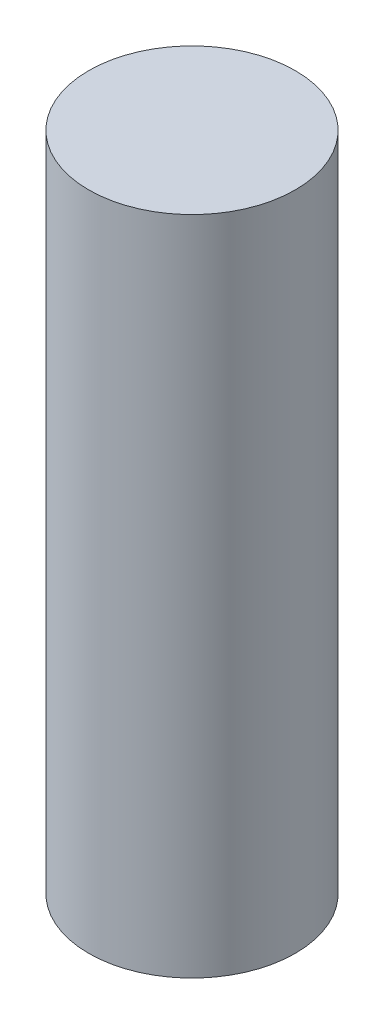
ISO-10303-21;
HEADER;
FILE_DESCRIPTION(('STEP AP214'),'2;1');
FILE_NAME('part.step','',(''),(''),'','','');
FILE_SCHEMA(('AUTOMOTIVE_DESIGN { 1 0 10303 214 1 1 1 1 }'));
ENDSEC;
DATA;
#1=APPLICATION_CONTEXT('core data for automotive mechanical design processes');
#2=APPLICATION_PROTOCOL_DEFINITION('international standard','automotive_design',2000,#1);
#3=PRODUCT_CONTEXT('',#1,'mechanical');
#4=PRODUCT('Part','Part','',(#3));
#5=PRODUCT_RELATED_PRODUCT_CATEGORY('part','',(#4));
#6=PRODUCT_DEFINITION_FORMATION('','',#4);
#7=PRODUCT_DEFINITION_CONTEXT('part definition',#1,'design');
#8=PRODUCT_DEFINITION('design','',#6,#7);
#9=PRODUCT_DEFINITION_SHAPE('','',#8);
#10=(LENGTH_UNIT() NAMED_UNIT(*) SI_UNIT(.MILLI.,.METRE.));
#11=(NAMED_UNIT(*) PLANE_ANGLE_UNIT() SI_UNIT($,.RADIAN.));
#12=(NAMED_UNIT(*) SI_UNIT($,.STERADIAN.) SOLID_ANGLE_UNIT());
#13=UNCERTAINTY_MEASURE_WITH_UNIT(LENGTH_MEASURE(1.E-05),#10,'distance_accuracy_value','');
#14=(GEOMETRIC_REPRESENTATION_CONTEXT(3) GLOBAL_UNCERTAINTY_ASSIGNED_CONTEXT((#13)) GLOBAL_UNIT_ASSIGNED_CONTEXT((#10,
#11,#12)) REPRESENTATION_CONTEXT('',''));
#15=CARTESIAN_POINT('',(0.,0.,0.));
#16=DIRECTION('',(0.,0.,1.));
#17=DIRECTION('',(1.,0.,0.));
#18=AXIS2_PLACEMENT_3D('',#15,#16,#17);
#19=CARTESIAN_POINT('',(0.,1.,0.));
#20=DIRECTION('',(0.,-1.,0.));
#21=DIRECTION('',(0.,0.,-1.));
#22=AXIS2_PLACEMENT_3D('',#19,#20,#21);
#23=CYLINDRICAL_SURFACE('',#22,0.3125);
#24=CARTESIAN_POINT('',(0.,1.,0.));
#25=DIRECTION('',(0.,1.,0.));
#26=DIRECTION('',(0.,0.,1.));
#27=AXIS2_PLACEMENT_3D('',#24,#25,#26);
#28=CIRCLE('',#27,0.3125);
#29=CARTESIAN_POINT('',(0.,1.,0.3125));
#30=VERTEX_POINT('',#29);
#31=EDGE_CURVE('E10',#30,#30,#28,.T.);
#32=ORIENTED_EDGE('',*,*,#31,.F.);
#33=EDGE_LOOP('',(#32));
#34=FACE_BOUND('',#33,.T.);
#35=CARTESIAN_POINT('',(0.,-1.,0.));
#36=DIRECTION('',(0.,1.,0.));
#37=DIRECTION('',(0.,0.,1.));
#38=AXIS2_PLACEMENT_3D('',#35,#36,#37);
#39=CIRCLE('',#38,0.3125);
#40=CARTESIAN_POINT('',(0.,-1.,0.3125));
#41=VERTEX_POINT('',#40);
#42=EDGE_CURVE('E40',#41,#41,#39,.T.);
#43=ORIENTED_EDGE('',*,*,#42,.T.);
#44=EDGE_LOOP('',(#43));
#45=FACE_BOUND('',#44,.T.);
#46=ADVANCED_FACE('F37',(#34,#45),#23,.T.);
#47=CARTESIAN_POINT('',(0.,1.,0.));
#48=DIRECTION('',(0.,1.,0.));
#49=DIRECTION('',(0.,0.,1.));
#50=AXIS2_PLACEMENT_3D('',#47,#48,#49);
#51=PLANE('',#50);
#52=ORIENTED_EDGE('',*,*,#31,.T.);
#53=EDGE_LOOP('',(#52));
#54=FACE_BOUND('',#53,.T.);
#55=ADVANCED_FACE('F54',(#54),#51,.T.);
#56=CARTESIAN_POINT('',(0.,-1.,0.));
#57=DIRECTION('',(0.,1.,0.));
#58=DIRECTION('',(0.,0.,1.));
#59=AXIS2_PLACEMENT_3D('',#56,#57,#58);
#60=PLANE('',#59);
#61=ORIENTED_EDGE('',*,*,#42,.F.);
#62=EDGE_LOOP('',(#61));
#63=FACE_BOUND('',#62,.T.);
#64=ADVANCED_FACE('F52',(#63),#60,.F.);
#65=CLOSED_SHELL('',(#46,#55,#64));
#66=MANIFOLD_SOLID_BREP('B2',#65);
#67=ADVANCED_BREP_SHAPE_REPRESENTATION('',(#18,#66),#14);
#68=SHAPE_DEFINITION_REPRESENTATION(#9,#67);
ENDSEC;
END-ISO-10303-21;
